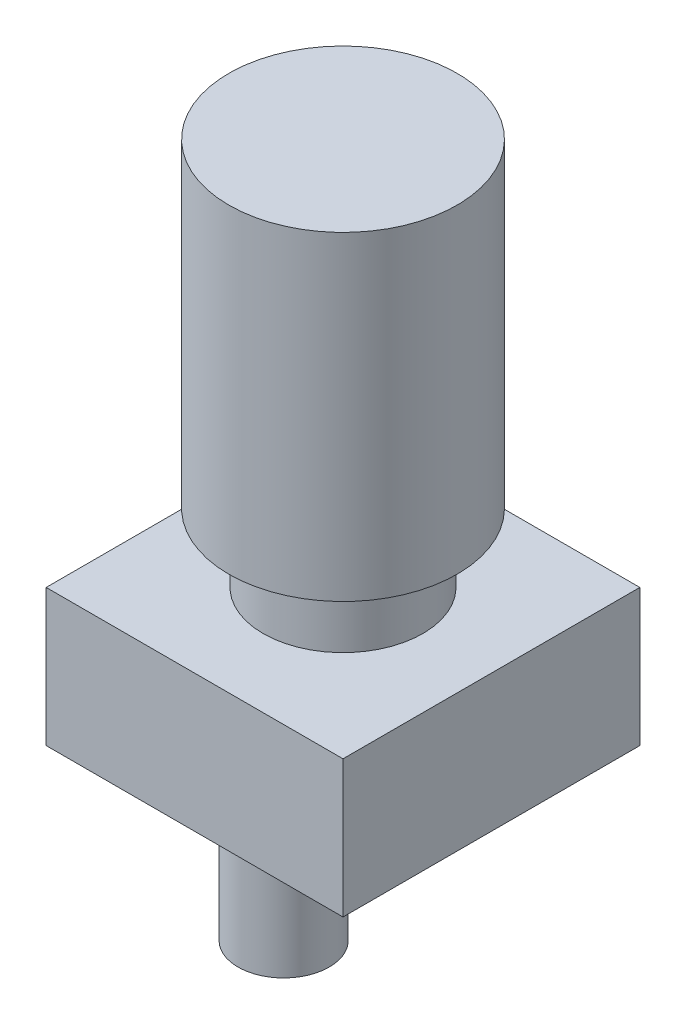
ISO-10303-21;
HEADER;
FILE_DESCRIPTION(('STEP AP214'),'2;1');
FILE_NAME('part.step','',(''),(''),'','','');
FILE_SCHEMA(('AUTOMOTIVE_DESIGN { 1 0 10303 214 1 1 1 1 }'));
ENDSEC;
DATA;
#1=APPLICATION_CONTEXT('core data for automotive mechanical design processes');
#2=APPLICATION_PROTOCOL_DEFINITION('international standard','automotive_design',2000,#1);
#3=PRODUCT_CONTEXT('',#1,'mechanical');
#4=PRODUCT('Part','Part','',(#3));
#5=PRODUCT_RELATED_PRODUCT_CATEGORY('part','',(#4));
#6=PRODUCT_DEFINITION_FORMATION('','',#4);
#7=PRODUCT_DEFINITION_CONTEXT('part definition',#1,'design');
#8=PRODUCT_DEFINITION('design','',#6,#7);
#9=PRODUCT_DEFINITION_SHAPE('','',#8);
#10=(LENGTH_UNIT() NAMED_UNIT(*) SI_UNIT(.MILLI.,.METRE.));
#11=(NAMED_UNIT(*) PLANE_ANGLE_UNIT() SI_UNIT($,.RADIAN.));
#12=(NAMED_UNIT(*) SI_UNIT($,.STERADIAN.) SOLID_ANGLE_UNIT());
#13=UNCERTAINTY_MEASURE_WITH_UNIT(LENGTH_MEASURE(1.E-05),#10,'distance_accuracy_value','');
#14=(GEOMETRIC_REPRESENTATION_CONTEXT(3) GLOBAL_UNCERTAINTY_ASSIGNED_CONTEXT((#13)) GLOBAL_UNIT_ASSIGNED_CONTEXT((#10,
#11,#12)) REPRESENTATION_CONTEXT('',''));
#15=CARTESIAN_POINT('',(0.,0.,0.));
#16=DIRECTION('',(0.,0.,1.));
#17=DIRECTION('',(1.,0.,0.));
#18=AXIS2_PLACEMENT_3D('',#15,#16,#17);
#19=CARTESIAN_POINT('',(-12.500000122,-3.,0.500000039999997));
#20=DIRECTION('',(0.,-1.,0.));
#21=DIRECTION('',(0.,0.,-1.));
#22=AXIS2_PLACEMENT_3D('',#19,#20,#21);
#23=PLANE('',#22);
#24=CARTESIAN_POINT('',(-12.500000122,-3.,0.500000039999997));
#25=DIRECTION('',(0.,-1.,0.));
#26=DIRECTION('',(0.,0.,-1.));
#27=AXIS2_PLACEMENT_3D('',#24,#25,#26);
#28=CIRCLE('',#27,7.5);
#29=CARTESIAN_POINT('',(-12.500000122,-3.,-6.99999996));
#30=VERTEX_POINT('',#29);
#31=EDGE_CURVE('E128',#30,#30,#28,.T.);
#32=ORIENTED_EDGE('',*,*,#31,.T.);
#33=EDGE_LOOP('',(#32));
#34=FACE_BOUND('',#33,.T.);
#35=CARTESIAN_POINT('',(-12.500000122,-3.,0.500000039999997));
#36=DIRECTION('',(0.,-1.,0.));
#37=DIRECTION('',(0.,0.,-1.));
#38=AXIS2_PLACEMENT_3D('',#35,#36,#37);
#39=CIRCLE('',#38,4.);
#40=CARTESIAN_POINT('',(-12.500000122,-3.,-3.49999996));
#41=VERTEX_POINT('',#40);
#42=EDGE_CURVE('E122',#41,#41,#39,.T.);
#43=ORIENTED_EDGE('',*,*,#42,.F.);
#44=EDGE_LOOP('',(#43));
#45=FACE_BOUND('',#44,.T.);
#46=ADVANCED_FACE('F35',(#34,#45),#23,.T.);
#47=CARTESIAN_POINT('',(0.,0.,0.));
#48=DIRECTION('',(0.,1.,0.));
#49=DIRECTION('',(0.,0.,1.));
#50=AXIS2_PLACEMENT_3D('',#47,#48,#49);
#51=PLANE('',#50);
#52=DIRECTION('',(0.,0.,1.));
#53=VECTOR('',#52,1.);
#54=CARTESIAN_POINT('',(-32.5,0.,-32.5));
#55=LINE('',#54,#53);
#56=CARTESIAN_POINT('',(-32.5,0.,-32.5));
#57=VERTEX_POINT('',#56);
#58=CARTESIAN_POINT('',(-32.5,0.,32.5));
#59=VERTEX_POINT('',#58);
#60=EDGE_CURVE('E143',#57,#59,#55,.T.);
#61=ORIENTED_EDGE('',*,*,#60,.F.);
#62=DIRECTION('',(-1.,0.,0.));
#63=VECTOR('',#62,1.);
#64=CARTESIAN_POINT('',(-32.5,0.,-32.5));
#65=LINE('',#64,#63);
#66=CARTESIAN_POINT('',(32.5,0.,-32.5));
#67=VERTEX_POINT('',#66);
#68=EDGE_CURVE('E80',#67,#57,#65,.T.);
#69=ORIENTED_EDGE('',*,*,#68,.F.);
#70=DIRECTION('',(0.,0.,-1.));
#71=VECTOR('',#70,1.);
#72=CARTESIAN_POINT('',(32.5,0.,-32.5));
#73=LINE('',#72,#71);
#74=CARTESIAN_POINT('',(32.5,0.,32.5));
#75=VERTEX_POINT('',#74);
#76=EDGE_CURVE('E157',#75,#67,#73,.T.);
#77=ORIENTED_EDGE('',*,*,#76,.F.);
#78=DIRECTION('',(1.,0.,0.));
#79=VECTOR('',#78,1.);
#80=CARTESIAN_POINT('',(-32.5,0.,32.5));
#81=LINE('',#80,#79);
#82=EDGE_CURVE('E155',#59,#75,#81,.T.);
#83=ORIENTED_EDGE('',*,*,#82,.F.);
#84=EDGE_LOOP('',(#61,#69,#77,#83));
#85=FACE_BOUND('',#84,.T.);
#86=CARTESIAN_POINT('',(-12.500000122,0.,0.500000039999997));
#87=DIRECTION('',(0.,1.,0.));
#88=DIRECTION('',(0.,0.,1.));
#89=AXIS2_PLACEMENT_3D('',#86,#87,#88);
#90=CIRCLE('',#89,7.5);
#91=CARTESIAN_POINT('',(-12.500000122,0.,8.00000004));
#92=VERTEX_POINT('',#91);
#93=EDGE_CURVE('E11',#92,#92,#90,.F.);
#94=ORIENTED_EDGE('',*,*,#93,.F.);
#95=EDGE_LOOP('',(#94));
#96=FACE_BOUND('',#95,.T.);
#97=ADVANCED_FACE('F171',(#85,#96),#51,.F.);
#98=CARTESIAN_POINT('',(0.,30.,0.));
#99=DIRECTION('',(0.,1.,0.));
#100=DIRECTION('',(0.,0.,1.));
#101=AXIS2_PLACEMENT_3D('',#98,#99,#100);
#102=PLANE('',#101);
#103=DIRECTION('',(0.,0.,1.));
#104=VECTOR('',#103,1.);
#105=CARTESIAN_POINT('',(-32.5,30.,-32.5));
#106=LINE('',#105,#104);
#107=CARTESIAN_POINT('',(-32.5,30.,-32.5));
#108=VERTEX_POINT('',#107);
#109=CARTESIAN_POINT('',(-32.5,30.,32.5));
#110=VERTEX_POINT('',#109);
#111=EDGE_CURVE('E146',#108,#110,#106,.T.);
#112=ORIENTED_EDGE('',*,*,#111,.T.);
#113=DIRECTION('',(1.,0.,0.));
#114=VECTOR('',#113,1.);
#115=CARTESIAN_POINT('',(-32.5,30.,32.5));
#116=LINE('',#115,#114);
#117=CARTESIAN_POINT('',(32.5,30.,32.5));
#118=VERTEX_POINT('',#117);
#119=EDGE_CURVE('E88',#110,#118,#116,.T.);
#120=ORIENTED_EDGE('',*,*,#119,.T.);
#121=DIRECTION('',(0.,0.,-1.));
#122=VECTOR('',#121,1.);
#123=CARTESIAN_POINT('',(32.5,30.,-32.5));
#124=LINE('',#123,#122);
#125=CARTESIAN_POINT('',(32.5,30.,-32.5));
#126=VERTEX_POINT('',#125);
#127=EDGE_CURVE('E149',#118,#126,#124,.T.);
#128=ORIENTED_EDGE('',*,*,#127,.T.);
#129=DIRECTION('',(-1.,0.,0.));
#130=VECTOR('',#129,1.);
#131=CARTESIAN_POINT('',(-32.5,30.,-32.5));
#132=LINE('',#131,#130);
#133=EDGE_CURVE('E59',#126,#108,#132,.T.);
#134=ORIENTED_EDGE('',*,*,#133,.T.);
#135=EDGE_LOOP('',(#112,#120,#128,#134));
#136=FACE_BOUND('',#135,.T.);
#137=CARTESIAN_POINT('',(0.,30.,0.));
#138=DIRECTION('',(0.,1.,0.));
#139=DIRECTION('',(0.,0.,1.));
#140=AXIS2_PLACEMENT_3D('',#137,#138,#139);
#141=CIRCLE('',#140,17.5);
#142=CARTESIAN_POINT('',(0.,30.,17.5));
#143=VERTEX_POINT('',#142);
#144=EDGE_CURVE('E137',#143,#143,#141,.T.);
#145=ORIENTED_EDGE('',*,*,#144,.F.);
#146=EDGE_LOOP('',(#145));
#147=FACE_BOUND('',#146,.T.);
#148=ADVANCED_FACE('F179',(#136,#147),#102,.T.);
#149=CARTESIAN_POINT('',(-32.5,30.,-32.5));
#150=DIRECTION('',(1.,0.,0.));
#151=DIRECTION('',(0.,0.,-1.));
#152=AXIS2_PLACEMENT_3D('',#149,#150,#151);
#153=PLANE('',#152);
#154=ORIENTED_EDGE('',*,*,#60,.T.);
#155=DIRECTION('',(0.,-1.,0.));
#156=VECTOR('',#155,1.);
#157=CARTESIAN_POINT('',(-32.5,30.,32.5));
#158=LINE('',#157,#156);
#159=EDGE_CURVE('E43',#110,#59,#158,.T.);
#160=ORIENTED_EDGE('',*,*,#159,.F.);
#161=ORIENTED_EDGE('',*,*,#111,.F.);
#162=DIRECTION('',(0.,-1.,0.));
#163=VECTOR('',#162,1.);
#164=CARTESIAN_POINT('',(-32.5,30.,-32.5));
#165=LINE('',#164,#163);
#166=EDGE_CURVE('E152',#108,#57,#165,.T.);
#167=ORIENTED_EDGE('',*,*,#166,.T.);
#168=EDGE_LOOP('',(#154,#160,#161,#167));
#169=FACE_BOUND('',#168,.T.);
#170=ADVANCED_FACE('F37',(#169),#153,.F.);
#171=CARTESIAN_POINT('',(-32.5,30.,32.5));
#172=DIRECTION('',(0.,0.,-1.));
#173=DIRECTION('',(-1.,0.,0.));
#174=AXIS2_PLACEMENT_3D('',#171,#172,#173);
#175=PLANE('',#174);
#176=ORIENTED_EDGE('',*,*,#82,.T.);
#177=DIRECTION('',(0.,-1.,0.));
#178=VECTOR('',#177,1.);
#179=CARTESIAN_POINT('',(32.5,30.,32.5));
#180=LINE('',#179,#178);
#181=EDGE_CURVE('E163',#118,#75,#180,.T.);
#182=ORIENTED_EDGE('',*,*,#181,.F.);
#183=ORIENTED_EDGE('',*,*,#119,.F.);
#184=ORIENTED_EDGE('',*,*,#159,.T.);
#185=EDGE_LOOP('',(#176,#182,#183,#184));
#186=FACE_BOUND('',#185,.T.);
#187=ADVANCED_FACE('F166',(#186),#175,.F.);
#188=CARTESIAN_POINT('',(32.5,30.,-32.5));
#189=DIRECTION('',(-1.,0.,0.));
#190=DIRECTION('',(0.,0.,1.));
#191=AXIS2_PLACEMENT_3D('',#188,#189,#190);
#192=PLANE('',#191);
#193=ORIENTED_EDGE('',*,*,#76,.T.);
#194=DIRECTION('',(0.,-1.,0.));
#195=VECTOR('',#194,1.);
#196=CARTESIAN_POINT('',(32.5,30.,-32.5));
#197=LINE('',#196,#195);
#198=EDGE_CURVE('E161',#126,#67,#197,.T.);
#199=ORIENTED_EDGE('',*,*,#198,.F.);
#200=ORIENTED_EDGE('',*,*,#127,.F.);
#201=ORIENTED_EDGE('',*,*,#181,.T.);
#202=EDGE_LOOP('',(#193,#199,#200,#201));
#203=FACE_BOUND('',#202,.T.);
#204=ADVANCED_FACE('F176',(#203),#192,.F.);
#205=CARTESIAN_POINT('',(-32.5,30.,-32.5));
#206=DIRECTION('',(0.,0.,1.));
#207=DIRECTION('',(1.,0.,0.));
#208=AXIS2_PLACEMENT_3D('',#205,#206,#207);
#209=PLANE('',#208);
#210=ORIENTED_EDGE('',*,*,#68,.T.);
#211=ORIENTED_EDGE('',*,*,#166,.F.);
#212=ORIENTED_EDGE('',*,*,#133,.F.);
#213=ORIENTED_EDGE('',*,*,#198,.T.);
#214=EDGE_LOOP('',(#210,#211,#212,#213));
#215=FACE_BOUND('',#214,.T.);
#216=ADVANCED_FACE('F178',(#215),#209,.F.);
#217=CARTESIAN_POINT('',(0.,45.,0.));
#218=DIRECTION('',(0.,-1.,0.));
#219=DIRECTION('',(0.,0.,-1.));
#220=AXIS2_PLACEMENT_3D('',#217,#218,#219);
#221=CYLINDRICAL_SURFACE('',#220,17.5);
#222=CARTESIAN_POINT('',(0.,45.,0.));
#223=DIRECTION('',(0.,1.,0.));
#224=DIRECTION('',(0.,0.,1.));
#225=AXIS2_PLACEMENT_3D('',#222,#223,#224);
#226=CIRCLE('',#225,17.5);
#227=CARTESIAN_POINT('',(0.,45.,17.5));
#228=VERTEX_POINT('',#227);
#229=EDGE_CURVE('E140',#228,#228,#226,.T.);
#230=ORIENTED_EDGE('',*,*,#229,.F.);
#231=EDGE_LOOP('',(#230));
#232=FACE_BOUND('',#231,.T.);
#233=ORIENTED_EDGE('',*,*,#144,.T.);
#234=EDGE_LOOP('',(#233));
#235=FACE_BOUND('',#234,.T.);
#236=ADVANCED_FACE('F185',(#232,#235),#221,.T.);
#237=CARTESIAN_POINT('',(0.,45.,0.));
#238=DIRECTION('',(0.,1.,0.));
#239=DIRECTION('',(0.,0.,1.));
#240=AXIS2_PLACEMENT_3D('',#237,#238,#239);
#241=PLANE('',#240);
#242=CARTESIAN_POINT('',(0.,45.,0.));
#243=DIRECTION('',(0.,1.,0.));
#244=DIRECTION('',(0.,0.,1.));
#245=AXIS2_PLACEMENT_3D('',#242,#243,#244);
#246=CIRCLE('',#245,25.);
#247=CARTESIAN_POINT('',(0.,45.,25.));
#248=VERTEX_POINT('',#247);
#249=EDGE_CURVE('E133',#248,#248,#246,.T.);
#250=ORIENTED_EDGE('',*,*,#249,.F.);
#251=EDGE_LOOP('',(#250));
#252=FACE_BOUND('',#251,.T.);
#253=ORIENTED_EDGE('',*,*,#229,.T.);
#254=EDGE_LOOP('',(#253));
#255=FACE_BOUND('',#254,.T.);
#256=ADVANCED_FACE('F187',(#252,#255),#241,.F.);
#257=CARTESIAN_POINT('',(0.,115.,0.));
#258=DIRECTION('',(0.,-1.,0.));
#259=DIRECTION('',(0.,0.,-1.));
#260=AXIS2_PLACEMENT_3D('',#257,#258,#259);
#261=CYLINDRICAL_SURFACE('',#260,25.);
#262=CARTESIAN_POINT('',(0.,115.,0.));
#263=DIRECTION('',(0.,1.,0.));
#264=DIRECTION('',(0.,0.,1.));
#265=AXIS2_PLACEMENT_3D('',#262,#263,#264);
#266=CIRCLE('',#265,25.);
#267=CARTESIAN_POINT('',(0.,115.,25.));
#268=VERTEX_POINT('',#267);
#269=EDGE_CURVE('E134',#268,#268,#266,.T.);
#270=ORIENTED_EDGE('',*,*,#269,.F.);
#271=EDGE_LOOP('',(#270));
#272=FACE_BOUND('',#271,.T.);
#273=ORIENTED_EDGE('',*,*,#249,.T.);
#274=EDGE_LOOP('',(#273));
#275=FACE_BOUND('',#274,.T.);
#276=ADVANCED_FACE('F195',(#272,#275),#261,.T.);
#277=CARTESIAN_POINT('',(0.,115.,0.));
#278=DIRECTION('',(0.,1.,0.));
#279=DIRECTION('',(0.,0.,1.));
#280=AXIS2_PLACEMENT_3D('',#277,#278,#279);
#281=PLANE('',#280);
#282=ORIENTED_EDGE('',*,*,#269,.T.);
#283=EDGE_LOOP('',(#282));
#284=FACE_BOUND('',#283,.T.);
#285=ADVANCED_FACE('F218',(#284),#281,.T.);
#286=CARTESIAN_POINT('',(-12.500000122,-3.,0.500000039999997));
#287=DIRECTION('',(0.,1.,0.));
#288=DIRECTION('',(0.,0.,1.));
#289=AXIS2_PLACEMENT_3D('',#286,#287,#288);
#290=CYLINDRICAL_SURFACE('',#289,7.5);
#291=ORIENTED_EDGE('',*,*,#31,.F.);
#292=EDGE_LOOP('',(#291));
#293=FACE_BOUND('',#292,.T.);
#294=ORIENTED_EDGE('',*,*,#93,.T.);
#295=EDGE_LOOP('',(#294));
#296=FACE_BOUND('',#295,.T.);
#297=ADVANCED_FACE('F216',(#293,#296),#290,.T.);
#298=CARTESIAN_POINT('',(-12.500000122,-13.,0.500000039999997));
#299=DIRECTION('',(0.,1.,0.));
#300=DIRECTION('',(0.,0.,1.));
#301=AXIS2_PLACEMENT_3D('',#298,#299,#300);
#302=CYLINDRICAL_SURFACE('',#301,4.);
#303=CARTESIAN_POINT('',(-12.500000122,-13.,0.500000039999997));
#304=DIRECTION('',(0.,-1.,0.));
#305=DIRECTION('',(0.,0.,-1.));
#306=AXIS2_PLACEMENT_3D('',#303,#304,#305);
#307=CIRCLE('',#306,4.);
#308=CARTESIAN_POINT('',(-12.500000122,-13.,-3.49999996));
#309=VERTEX_POINT('',#308);
#310=EDGE_CURVE('E125',#309,#309,#307,.T.);
#311=ORIENTED_EDGE('',*,*,#310,.F.);
#312=EDGE_LOOP('',(#311));
#313=FACE_BOUND('',#312,.T.);
#314=ORIENTED_EDGE('',*,*,#42,.T.);
#315=EDGE_LOOP('',(#314));
#316=FACE_BOUND('',#315,.T.);
#317=ADVANCED_FACE('F214',(#313,#316),#302,.T.);
#318=CARTESIAN_POINT('',(-12.500000122,-13.,0.500000039999997));
#319=DIRECTION('',(0.,-1.,0.));
#320=DIRECTION('',(0.,0.,-1.));
#321=AXIS2_PLACEMENT_3D('',#318,#319,#320);
#322=PLANE('',#321);
#323=CARTESIAN_POINT('',(-12.500000122,-13.,0.500000039999997));
#324=DIRECTION('',(0.,-1.,0.));
#325=DIRECTION('',(0.,0.,-1.));
#326=AXIS2_PLACEMENT_3D('',#323,#324,#325);
#327=CIRCLE('',#326,10.);
#328=CARTESIAN_POINT('',(-12.500000122,-13.,-9.49999996));
#329=VERTEX_POINT('',#328);
#330=EDGE_CURVE('E117',#329,#329,#327,.T.);
#331=ORIENTED_EDGE('',*,*,#330,.F.);
#332=EDGE_LOOP('',(#331));
#333=FACE_BOUND('',#332,.T.);
#334=ORIENTED_EDGE('',*,*,#310,.T.);
#335=EDGE_LOOP('',(#334));
#336=FACE_BOUND('',#335,.T.);
#337=ADVANCED_FACE('F258',(#333,#336),#322,.F.);
#338=CARTESIAN_POINT('',(-12.500000122,-43.,0.500000039999997));
#339=DIRECTION('',(0.,1.,0.));
#340=DIRECTION('',(0.,0.,1.));
#341=AXIS2_PLACEMENT_3D('',#338,#339,#340);
#342=CYLINDRICAL_SURFACE('',#341,10.);
#343=CARTESIAN_POINT('',(-12.500000122,-43.,0.500000039999997));
#344=DIRECTION('',(0.,-1.,0.));
#345=DIRECTION('',(0.,0.,-1.));
#346=AXIS2_PLACEMENT_3D('',#343,#344,#345);
#347=CIRCLE('',#346,10.);
#348=CARTESIAN_POINT('',(-12.500000122,-43.,-9.49999996));
#349=VERTEX_POINT('',#348);
#350=EDGE_CURVE('E119',#349,#349,#347,.T.);
#351=ORIENTED_EDGE('',*,*,#350,.F.);
#352=EDGE_LOOP('',(#351));
#353=FACE_BOUND('',#352,.T.);
#354=ORIENTED_EDGE('',*,*,#330,.T.);
#355=EDGE_LOOP('',(#354));
#356=FACE_BOUND('',#355,.T.);
#357=ADVANCED_FACE('F252',(#353,#356),#342,.T.);
#358=CARTESIAN_POINT('',(-12.500000122,-43.,0.500000039999997));
#359=DIRECTION('',(0.,-1.,0.));
#360=DIRECTION('',(0.,0.,-1.));
#361=AXIS2_PLACEMENT_3D('',#358,#359,#360);
#362=PLANE('',#361);
#363=CARTESIAN_POINT('',(-12.4372548688364,-43.,2.32428533002001));
#364=DIRECTION('',(0.,-1.,0.));
#365=DIRECTION('',(0.,0.,-1.));
#366=AXIS2_PLACEMENT_3D('',#363,#364,#365);
#367=CIRCLE('',#366,5.35411927644434);
#368=CARTESIAN_POINT('',(-17.7338610020816,-43.,3.10694534283631));
#369=VERTEX_POINT('',#368);
#370=CARTESIAN_POINT('',(-7.14064873559112,-43.,3.10694534283631));
#371=VERTEX_POINT('',#370);
#372=EDGE_CURVE('E50',#369,#371,#367,.T.);
#373=ORIENTED_EDGE('',*,*,#372,.F.);
#374=DIRECTION('',(-1.,0.,0.));
#375=VECTOR('',#374,1.);
#376=CARTESIAN_POINT('',(-17.7338610020816,-43.,3.10694534283631));
#377=LINE('',#376,#375);
#378=EDGE_CURVE('E110',#371,#369,#377,.T.);
#379=ORIENTED_EDGE('',*,*,#378,.F.);
#380=EDGE_LOOP('',(#373,#379));
#381=FACE_BOUND('',#380,.T.);
#382=ORIENTED_EDGE('',*,*,#350,.T.);
#383=EDGE_LOOP('',(#382));
#384=FACE_BOUND('',#383,.T.);
#385=ADVANCED_FACE('F257',(#381,#384),#362,.T.);
#386=CARTESIAN_POINT('',(-12.4372548688364,-20.62,2.32428533002001));
#387=DIRECTION('',(0.,-1.,0.));
#388=DIRECTION('',(0.,0.,-1.));
#389=AXIS2_PLACEMENT_3D('',#386,#387,#388);
#390=CYLINDRICAL_SURFACE('',#389,5.35411927644434);
#391=ORIENTED_EDGE('',*,*,#372,.T.);
#392=DIRECTION('',(0.,-1.,0.));
#393=VECTOR('',#392,1.);
#394=CARTESIAN_POINT('',(-7.14064873559112,-20.62,3.10694534283631));
#395=LINE('',#394,#393);
#396=CARTESIAN_POINT('',(-7.14064873559112,-20.62,3.10694534283631));
#397=VERTEX_POINT('',#396);
#398=EDGE_CURVE('E96',#397,#371,#395,.T.);
#399=ORIENTED_EDGE('',*,*,#398,.F.);
#400=CARTESIAN_POINT('',(-12.4372548688364,-20.62,2.32428533002001));
#401=DIRECTION('',(0.,-1.,0.));
#402=DIRECTION('',(0.,0.,-1.));
#403=AXIS2_PLACEMENT_3D('',#400,#401,#402);
#404=CIRCLE('',#403,5.35411927644434);
#405=CARTESIAN_POINT('',(-17.7338610020816,-20.62,3.10694534283631));
#406=VERTEX_POINT('',#405);
#407=EDGE_CURVE('E99',#406,#397,#404,.T.);
#408=ORIENTED_EDGE('',*,*,#407,.F.);
#409=DIRECTION('',(0.,-1.,0.));
#410=VECTOR('',#409,1.);
#411=CARTESIAN_POINT('',(-17.7338610020816,-20.62,3.10694534283631));
#412=LINE('',#411,#410);
#413=EDGE_CURVE('E105',#406,#369,#412,.T.);
#414=ORIENTED_EDGE('',*,*,#413,.T.);
#415=EDGE_LOOP('',(#391,#399,#408,#414));
#416=FACE_BOUND('',#415,.T.);
#417=ADVANCED_FACE('F98',(#416),#390,.F.);
#418=CARTESIAN_POINT('',(-17.7338610020816,-20.62,3.10694534283631));
#419=DIRECTION('',(0.,0.,1.));
#420=DIRECTION('',(1.,0.,0.));
#421=AXIS2_PLACEMENT_3D('',#418,#419,#420);
#422=PLANE('',#421);
#423=ORIENTED_EDGE('',*,*,#378,.T.);
#424=ORIENTED_EDGE('',*,*,#413,.F.);
#425=DIRECTION('',(-1.,0.,0.));
#426=VECTOR('',#425,1.);
#427=CARTESIAN_POINT('',(-17.7338610020816,-20.62,3.10694534283631));
#428=LINE('',#427,#426);
#429=EDGE_CURVE('E106',#397,#406,#428,.T.);
#430=ORIENTED_EDGE('',*,*,#429,.F.);
#431=ORIENTED_EDGE('',*,*,#398,.T.);
#432=EDGE_LOOP('',(#423,#424,#430,#431));
#433=FACE_BOUND('',#432,.T.);
#434=ADVANCED_FACE('F112',(#433),#422,.F.);
#435=CARTESIAN_POINT('',(-12.4372548688364,-20.62,2.32428533002001));
#436=DIRECTION('',(0.,-1.,0.));
#437=DIRECTION('',(0.,0.,-1.));
#438=AXIS2_PLACEMENT_3D('',#435,#436,#437);
#439=PLANE('',#438);
#440=ORIENTED_EDGE('',*,*,#407,.T.);
#441=ORIENTED_EDGE('',*,*,#429,.T.);
#442=EDGE_LOOP('',(#440,#441));
#443=FACE_BOUND('',#442,.T.);
#444=ADVANCED_FACE('F109',(#443),#439,.T.);
#445=CLOSED_SHELL('',(#46,#97,#148,#170,#187,#204,#216,#236,#256,#276,#285,#297,#317,#337,#357,
#385,#417,#434,#444));
#446=MANIFOLD_SOLID_BREP('B2',#445);
#447=ADVANCED_BREP_SHAPE_REPRESENTATION('',(#18,#446),#14);
#448=SHAPE_DEFINITION_REPRESENTATION(#9,#447);
ENDSEC;
END-ISO-10303-21;
